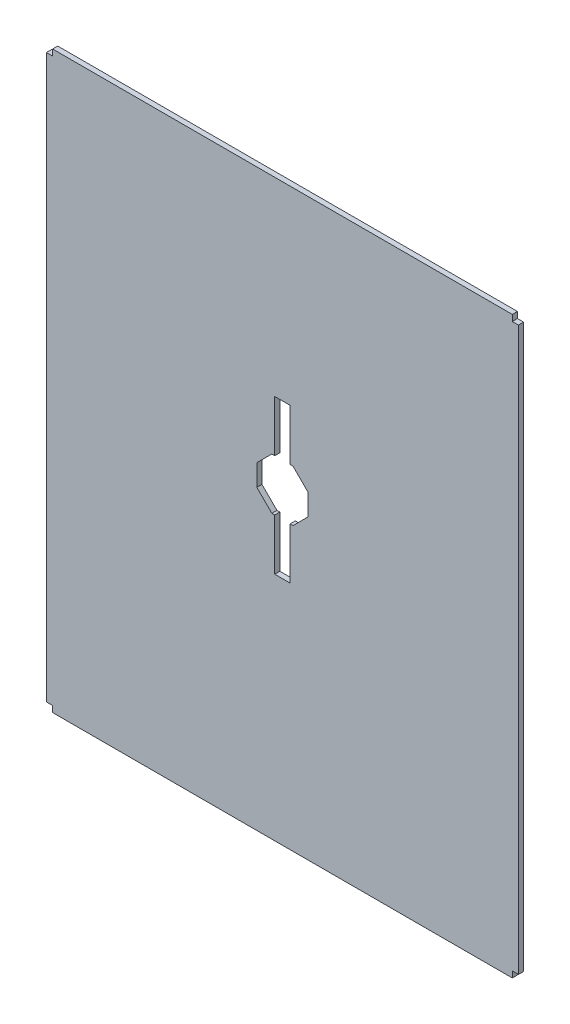
ISO-10303-21;
HEADER;
FILE_DESCRIPTION(('STEP AP214'),'2;1');
FILE_NAME('part.step','',(''),(''),'','','');
FILE_SCHEMA(('AUTOMOTIVE_DESIGN { 1 0 10303 214 1 1 1 1 }'));
ENDSEC;
DATA;
#1=APPLICATION_CONTEXT('core data for automotive mechanical design processes');
#2=APPLICATION_PROTOCOL_DEFINITION('international standard','automotive_design',2000,#1);
#3=PRODUCT_CONTEXT('',#1,'mechanical');
#4=PRODUCT('Part','Part','',(#3));
#5=PRODUCT_RELATED_PRODUCT_CATEGORY('part','',(#4));
#6=PRODUCT_DEFINITION_FORMATION('','',#4);
#7=PRODUCT_DEFINITION_CONTEXT('part definition',#1,'design');
#8=PRODUCT_DEFINITION('design','',#6,#7);
#9=PRODUCT_DEFINITION_SHAPE('','',#8);
#10=(LENGTH_UNIT() NAMED_UNIT(*) SI_UNIT(.MILLI.,.METRE.));
#11=(NAMED_UNIT(*) PLANE_ANGLE_UNIT() SI_UNIT($,.RADIAN.));
#12=(NAMED_UNIT(*) SI_UNIT($,.STERADIAN.) SOLID_ANGLE_UNIT());
#13=UNCERTAINTY_MEASURE_WITH_UNIT(LENGTH_MEASURE(1.E-05),#10,'distance_accuracy_value','');
#14=(GEOMETRIC_REPRESENTATION_CONTEXT(3) GLOBAL_UNCERTAINTY_ASSIGNED_CONTEXT((#13)) GLOBAL_UNIT_ASSIGNED_CONTEXT((#10,
#11,#12)) REPRESENTATION_CONTEXT('',''));
#15=CARTESIAN_POINT('',(0.,0.,0.));
#16=DIRECTION('',(0.,0.,1.));
#17=DIRECTION('',(1.,0.,0.));
#18=AXIS2_PLACEMENT_3D('',#15,#16,#17);
#19=CARTESIAN_POINT('',(230.,-280.,0.));
#20=DIRECTION('',(1.,0.,0.));
#21=DIRECTION('',(0.,1.,0.));
#22=AXIS2_PLACEMENT_3D('',#19,#20,#21);
#23=PLANE('',#22);
#24=DIRECTION('',(0.,0.,-1.));
#25=VECTOR('',#24,1.);
#26=CARTESIAN_POINT('',(230.,-274.,2.5));
#27=LINE('',#26,#25);
#28=CARTESIAN_POINT('',(230.,-274.,5.));
#29=VERTEX_POINT('',#28);
#30=CARTESIAN_POINT('',(230.,-274.,0.));
#31=VERTEX_POINT('',#30);
#32=EDGE_CURVE('E11',#29,#31,#27,.T.);
#33=ORIENTED_EDGE('',*,*,#32,.T.);
#34=DIRECTION('',(0.,1.,0.));
#35=VECTOR('',#34,1.);
#36=CARTESIAN_POINT('',(230.,-280.,0.));
#37=LINE('',#36,#35);
#38=CARTESIAN_POINT('',(230.,274.,0.));
#39=VERTEX_POINT('',#38);
#40=EDGE_CURVE('E24',#31,#39,#37,.T.);
#41=ORIENTED_EDGE('',*,*,#40,.T.);
#42=DIRECTION('',(0.,0.,1.));
#43=VECTOR('',#42,1.);
#44=CARTESIAN_POINT('',(230.,274.,0.));
#45=LINE('',#44,#43);
#46=CARTESIAN_POINT('',(230.,274.,5.));
#47=VERTEX_POINT('',#46);
#48=EDGE_CURVE('E502',#39,#47,#45,.T.);
#49=ORIENTED_EDGE('',*,*,#48,.T.);
#50=DIRECTION('',(0.,1.,0.));
#51=VECTOR('',#50,1.);
#52=CARTESIAN_POINT('',(230.,-280.,5.));
#53=LINE('',#52,#51);
#54=EDGE_CURVE('E499',#29,#47,#53,.T.);
#55=ORIENTED_EDGE('',*,*,#54,.F.);
#56=EDGE_LOOP('',(#33,#41,#49,#55));
#57=FACE_BOUND('',#56,.T.);
#58=ADVANCED_FACE('F16',(#57),#23,.T.);
#59=CARTESIAN_POINT('',(7.5,45.0088313866877,0.));
#60=DIRECTION('',(0.00117513237163571,-0.999999309531716,0.));
#61=DIRECTION('',(0.999999309531716,0.00117513237163571,0.));
#62=AXIS2_PLACEMENT_3D('',#59,#60,#61);
#63=PLANE('',#62);
#64=DIRECTION('',(0.999999309531716,0.00117513237163571,0.));
#65=VECTOR('',#64,1.);
#66=CARTESIAN_POINT('',(7.5,45.0088313866877,0.));
#67=LINE('',#66,#65);
#68=CARTESIAN_POINT('',(-10.3852430058506,44.987813844145,0.));
#69=VERTEX_POINT('',#68);
#70=CARTESIAN_POINT('',(-7.5,44.9912043889422,0.));
#71=VERTEX_POINT('',#70);
#72=EDGE_CURVE('E497',#69,#71,#67,.T.);
#73=ORIENTED_EDGE('',*,*,#72,.T.);
#74=DIRECTION('',(0.,0.,1.));
#75=VECTOR('',#74,1.);
#76=CARTESIAN_POINT('',(-7.5,44.9912043889423,0.));
#77=LINE('',#76,#75);
#78=CARTESIAN_POINT('',(-7.5,44.9912043889422,5.));
#79=VERTEX_POINT('',#78);
#80=EDGE_CURVE('E495',#71,#79,#77,.T.);
#81=ORIENTED_EDGE('',*,*,#80,.T.);
#82=DIRECTION('',(0.999999309531716,0.00117513237163571,0.));
#83=VECTOR('',#82,1.);
#84=CARTESIAN_POINT('',(-0.0528809412315551,44.9999557456662,5.));
#85=LINE('',#84,#83);
#86=CARTESIAN_POINT('',(-10.3852430058506,44.987813844145,5.));
#87=VERTEX_POINT('',#86);
#88=EDGE_CURVE('E492',#87,#79,#85,.T.);
#89=ORIENTED_EDGE('',*,*,#88,.F.);
#90=DIRECTION('',(0.,0.,1.));
#91=VECTOR('',#90,1.);
#92=CARTESIAN_POINT('',(-10.3852430058506,44.987813844145,0.));
#93=LINE('',#92,#91);
#94=EDGE_CURVE('E489',#69,#87,#93,.T.);
#95=ORIENTED_EDGE('',*,*,#94,.F.);
#96=EDGE_LOOP('',(#73,#81,#89,#95));
#97=FACE_BOUND('',#96,.T.);
#98=ADVANCED_FACE('F553',(#97),#63,.T.);
#99=CARTESIAN_POINT('',(-7.5,-55.,0.));
#100=DIRECTION('',(1.,0.,0.));
#101=DIRECTION('',(0.,1.,0.));
#102=AXIS2_PLACEMENT_3D('',#99,#100,#101);
#103=PLANE('',#102);
#104=DIRECTION('',(0.,1.,0.));
#105=VECTOR('',#104,1.);
#106=CARTESIAN_POINT('',(-7.5,-55.,0.));
#107=LINE('',#106,#105);
#108=CARTESIAN_POINT('',(-7.5,95.,0.));
#109=VERTEX_POINT('',#108);
#110=EDGE_CURVE('E487',#71,#109,#107,.T.);
#111=ORIENTED_EDGE('',*,*,#110,.T.);
#112=DIRECTION('',(0.,0.,1.));
#113=VECTOR('',#112,1.);
#114=CARTESIAN_POINT('',(-7.5,95.,0.));
#115=LINE('',#114,#113);
#116=CARTESIAN_POINT('',(-7.5,95.,5.));
#117=VERTEX_POINT('',#116);
#118=EDGE_CURVE('E485',#109,#117,#115,.T.);
#119=ORIENTED_EDGE('',*,*,#118,.T.);
#120=DIRECTION('',(0.,1.,0.));
#121=VECTOR('',#120,1.);
#122=CARTESIAN_POINT('',(-7.5,0.,5.));
#123=LINE('',#122,#121);
#124=EDGE_CURVE('E482',#79,#117,#123,.T.);
#125=ORIENTED_EDGE('',*,*,#124,.F.);
#126=ORIENTED_EDGE('',*,*,#80,.F.);
#127=EDGE_LOOP('',(#111,#119,#125,#126));
#128=FACE_BOUND('',#127,.T.);
#129=ADVANCED_FACE('F557',(#128),#103,.T.);
#130=CARTESIAN_POINT('',(-7.5,95.,0.));
#131=DIRECTION('',(0.,-1.,0.));
#132=DIRECTION('',(1.,0.,0.));
#133=AXIS2_PLACEMENT_3D('',#130,#131,#132);
#134=PLANE('',#133);
#135=DIRECTION('',(1.,0.,0.));
#136=VECTOR('',#135,1.);
#137=CARTESIAN_POINT('',(-7.5,95.,0.));
#138=LINE('',#137,#136);
#139=CARTESIAN_POINT('',(7.5,95.,0.));
#140=VERTEX_POINT('',#139);
#141=EDGE_CURVE('E480',#109,#140,#138,.T.);
#142=ORIENTED_EDGE('',*,*,#141,.T.);
#143=DIRECTION('',(0.,0.,1.));
#144=VECTOR('',#143,1.);
#145=CARTESIAN_POINT('',(7.5,95.,0.));
#146=LINE('',#145,#144);
#147=CARTESIAN_POINT('',(7.5,95.,5.));
#148=VERTEX_POINT('',#147);
#149=EDGE_CURVE('E478',#140,#148,#146,.T.);
#150=ORIENTED_EDGE('',*,*,#149,.T.);
#151=DIRECTION('',(1.,0.,0.));
#152=VECTOR('',#151,1.);
#153=CARTESIAN_POINT('',(-7.5,95.,5.));
#154=LINE('',#153,#152);
#155=EDGE_CURVE('E475',#117,#148,#154,.T.);
#156=ORIENTED_EDGE('',*,*,#155,.F.);
#157=ORIENTED_EDGE('',*,*,#118,.F.);
#158=EDGE_LOOP('',(#142,#150,#156,#157));
#159=FACE_BOUND('',#158,.T.);
#160=ADVANCED_FACE('F563',(#159),#134,.T.);
#161=CARTESIAN_POINT('',(7.5,-4.99120313675039,0.));
#162=DIRECTION('',(-1.,0.,0.));
#163=DIRECTION('',(0.,-1.,0.));
#164=AXIS2_PLACEMENT_3D('',#161,#162,#163);
#165=PLANE('',#164);
#166=DIRECTION('',(0.,-1.,0.));
#167=VECTOR('',#166,1.);
#168=CARTESIAN_POINT('',(7.5,-4.99120313675039,0.));
#169=LINE('',#168,#167);
#170=CARTESIAN_POINT('',(7.5,45.0088313866877,0.));
#171=VERTEX_POINT('',#170);
#172=EDGE_CURVE('E473',#140,#171,#169,.T.);
#173=ORIENTED_EDGE('',*,*,#172,.T.);
#174=DIRECTION('',(0.,0.,1.));
#175=VECTOR('',#174,1.);
#176=CARTESIAN_POINT('',(7.5,45.0088313866877,0.));
#177=LINE('',#176,#175);
#178=CARTESIAN_POINT('',(7.5,45.0088313866877,5.));
#179=VERTEX_POINT('',#178);
#180=EDGE_CURVE('E471',#171,#179,#177,.T.);
#181=ORIENTED_EDGE('',*,*,#180,.T.);
#182=DIRECTION('',(0.,-1.,0.));
#183=VECTOR('',#182,1.);
#184=CARTESIAN_POINT('',(7.5,0.,5.));
#185=LINE('',#184,#183);
#186=EDGE_CURVE('E466',#148,#179,#185,.T.);
#187=ORIENTED_EDGE('',*,*,#186,.F.);
#188=ORIENTED_EDGE('',*,*,#149,.F.);
#189=EDGE_LOOP('',(#173,#181,#187,#188));
#190=FACE_BOUND('',#189,.T.);
#191=ADVANCED_FACE('F569',(#190),#165,.T.);
#192=DIRECTION('',(0.999999309531716,0.00117513237163571,0.));
#193=VECTOR('',#192,1.);
#194=CARTESIAN_POINT('',(10.3254208127377,45.0121516324407,0.));
#195=LINE('',#194,#193);
#196=CARTESIAN_POINT('',(10.3254208127377,45.0121516324407,0.));
#197=VERTEX_POINT('',#196);
#198=EDGE_CURVE('E462',#171,#197,#195,.T.);
#199=ORIENTED_EDGE('',*,*,#198,.T.);
#200=DIRECTION('',(0.,0.,1.));
#201=VECTOR('',#200,1.);
#202=CARTESIAN_POINT('',(10.3254208127377,45.0121516324407,0.));
#203=LINE('',#202,#201);
#204=CARTESIAN_POINT('',(10.3254208127377,45.0121516324407,5.));
#205=VERTEX_POINT('',#204);
#206=EDGE_CURVE('E458',#197,#205,#203,.T.);
#207=ORIENTED_EDGE('',*,*,#206,.T.);
#208=DIRECTION('',(0.999999309531716,0.00117513237163571,0.));
#209=VECTOR('',#208,1.);
#210=CARTESIAN_POINT('',(10.3254208127377,45.0121516324407,5.));
#211=LINE('',#210,#209);
#212=EDGE_CURVE('E453',#179,#205,#211,.T.);
#213=ORIENTED_EDGE('',*,*,#212,.F.);
#214=ORIENTED_EDGE('',*,*,#180,.F.);
#215=EDGE_LOOP('',(#199,#207,#213,#214));
#216=FACE_BOUND('',#215,.T.);
#217=ADVANCED_FACE('F559',(#216),#63,.T.);
#218=CARTESIAN_POINT('',(10.3254208127377,45.0121516324407,0.));
#219=DIRECTION('',(-0.706275348882967,-0.707937237020517,0.));
#220=DIRECTION('',(0.707937237020517,-0.706275348882967,0.));
#221=AXIS2_PLACEMENT_3D('',#218,#219,#220);
#222=PLANE('',#221);
#223=DIRECTION('',(0.707937237020517,-0.706275348882967,0.));
#224=VECTOR('',#223,1.);
#225=CARTESIAN_POINT('',(24.9872810568795,30.384710218585,0.));
#226=LINE('',#225,#224);
#227=CARTESIAN_POINT('',(24.9872810568795,30.384710218585,0.));
#228=VERTEX_POINT('',#227);
#229=EDGE_CURVE('E449',#197,#228,#226,.T.);
#230=ORIENTED_EDGE('',*,*,#229,.T.);
#231=DIRECTION('',(0.,0.,1.));
#232=VECTOR('',#231,1.);
#233=CARTESIAN_POINT('',(24.9872810568795,30.384710218585,0.));
#234=LINE('',#233,#232);
#235=CARTESIAN_POINT('',(24.9872810568795,30.384710218585,5.));
#236=VERTEX_POINT('',#235);
#237=EDGE_CURVE('E445',#228,#236,#234,.T.);
#238=ORIENTED_EDGE('',*,*,#237,.T.);
#239=DIRECTION('',(0.707937237020517,-0.706275348882967,0.));
#240=VECTOR('',#239,1.);
#241=CARTESIAN_POINT('',(24.9872810568795,30.384710218585,5.));
#242=LINE('',#241,#240);
#243=EDGE_CURVE('E440',#205,#236,#242,.T.);
#244=ORIENTED_EDGE('',*,*,#243,.F.);
#245=ORIENTED_EDGE('',*,*,#206,.F.);
#246=EDGE_LOOP('',(#230,#238,#244,#245));
#247=FACE_BOUND('',#246,.T.);
#248=ADVANCED_FACE('F568',(#247),#222,.T.);
#249=CARTESIAN_POINT('',(24.9872810568795,30.384710218585,0.));
#250=DIRECTION('',(-0.999999309531716,-0.00117513237163549,0.));
#251=DIRECTION('',(0.00117513237163549,-0.999999309531716,0.));
#252=AXIS2_PLACEMENT_3D('',#249,#250,#251);
#253=PLANE('',#252);
#254=DIRECTION('',(0.00117513237163549,-0.999999309531716,0.));
#255=VECTOR('',#254,1.);
#256=CARTESIAN_POINT('',(25.0116188451752,9.67404639999663,0.));
#257=LINE('',#256,#255);
#258=CARTESIAN_POINT('',(25.0116188451752,9.67404639999663,0.));
#259=VERTEX_POINT('',#258);
#260=EDGE_CURVE('E436',#228,#259,#257,.T.);
#261=ORIENTED_EDGE('',*,*,#260,.T.);
#262=DIRECTION('',(0.,0.,1.));
#263=VECTOR('',#262,1.);
#264=CARTESIAN_POINT('',(25.0116188451752,9.67404639999663,0.));
#265=LINE('',#264,#263);
#266=CARTESIAN_POINT('',(25.0116188451752,9.67404639999663,5.));
#267=VERTEX_POINT('',#266);
#268=EDGE_CURVE('E432',#259,#267,#265,.T.);
#269=ORIENTED_EDGE('',*,*,#268,.T.);
#270=DIRECTION('',(0.00117513237163549,-0.999999309531716,0.));
#271=VECTOR('',#270,1.);
#272=CARTESIAN_POINT('',(25.0116188451752,9.67404639999663,5.));
#273=LINE('',#272,#271);
#274=EDGE_CURVE('E427',#236,#267,#273,.T.);
#275=ORIENTED_EDGE('',*,*,#274,.F.);
#276=ORIENTED_EDGE('',*,*,#237,.F.);
#277=EDGE_LOOP('',(#261,#269,#275,#276));
#278=FACE_BOUND('',#277,.T.);
#279=ADVANCED_FACE('F575',(#278),#253,.T.);
#280=CARTESIAN_POINT('',(25.0116188451752,9.67404639999663,0.));
#281=DIRECTION('',(-0.707937237020517,0.706275348882967,0.));
#282=DIRECTION('',(-0.706275348882967,-0.707937237020517,0.));
#283=AXIS2_PLACEMENT_3D('',#280,#281,#282);
#284=PLANE('',#283);
#285=DIRECTION('',(-0.706275348882967,-0.707937237020517,0.));
#286=VECTOR('',#285,1.);
#287=CARTESIAN_POINT('',(10.3841774313195,-4.9878138441451,0.));
#288=LINE('',#287,#286);
#289=CARTESIAN_POINT('',(10.3841774313195,-4.9878138441451,0.));
#290=VERTEX_POINT('',#289);
#291=EDGE_CURVE('E425',#259,#290,#288,.T.);
#292=ORIENTED_EDGE('',*,*,#291,.T.);
#293=DIRECTION('',(0.,0.,1.));
#294=VECTOR('',#293,1.);
#295=CARTESIAN_POINT('',(10.3841774313195,-4.9878138441451,0.));
#296=LINE('',#295,#294);
#297=CARTESIAN_POINT('',(10.3841774313195,-4.9878138441451,5.));
#298=VERTEX_POINT('',#297);
#299=EDGE_CURVE('E421',#290,#298,#296,.T.);
#300=ORIENTED_EDGE('',*,*,#299,.T.);
#301=DIRECTION('',(-0.706275348882967,-0.707937237020517,0.));
#302=VECTOR('',#301,1.);
#303=CARTESIAN_POINT('',(10.3841774313195,-4.9878138441451,5.));
#304=LINE('',#303,#302);
#305=EDGE_CURVE('E418',#267,#298,#304,.T.);
#306=ORIENTED_EDGE('',*,*,#305,.F.);
#307=ORIENTED_EDGE('',*,*,#268,.F.);
#308=EDGE_LOOP('',(#292,#300,#306,#307));
#309=FACE_BOUND('',#308,.T.);
#310=ADVANCED_FACE('F599',(#309),#284,.T.);
#311=CARTESIAN_POINT('',(-7.5,-5.0088301344958,0.));
#312=DIRECTION('',(-0.00117513237163539,0.999999309531716,0.));
#313=DIRECTION('',(-0.999999309531716,-0.00117513237163539,0.));
#314=AXIS2_PLACEMENT_3D('',#311,#312,#313);
#315=PLANE('',#314);
#316=DIRECTION('',(-0.999999309531716,-0.00117513237163539,0.));
#317=VECTOR('',#316,1.);
#318=CARTESIAN_POINT('',(-7.5,-5.0088301344958,0.));
#319=LINE('',#318,#317);
#320=CARTESIAN_POINT('',(7.5,-4.99120313675038,0.));
#321=VERTEX_POINT('',#320);
#322=EDGE_CURVE('E416',#290,#321,#319,.T.);
#323=ORIENTED_EDGE('',*,*,#322,.T.);
#324=DIRECTION('',(0.,0.,1.));
#325=VECTOR('',#324,1.);
#326=CARTESIAN_POINT('',(7.5,-4.99120313675039,0.));
#327=LINE('',#326,#325);
#328=CARTESIAN_POINT('',(7.5,-4.99120313675038,5.));
#329=VERTEX_POINT('',#328);
#330=EDGE_CURVE('E414',#321,#329,#327,.T.);
#331=ORIENTED_EDGE('',*,*,#330,.T.);
#332=DIRECTION('',(-0.999999309531716,-0.00117513237163539,0.));
#333=VECTOR('',#332,1.);
#334=CARTESIAN_POINT('',(0.00587567735022894,-5.00000973091967,5.));
#335=LINE('',#334,#333);
#336=EDGE_CURVE('E409',#298,#329,#335,.T.);
#337=ORIENTED_EDGE('',*,*,#336,.F.);
#338=ORIENTED_EDGE('',*,*,#299,.F.);
#339=EDGE_LOOP('',(#323,#331,#337,#338));
#340=FACE_BOUND('',#339,.T.);
#341=ADVANCED_FACE('F646',(#340),#315,.T.);
#342=DIRECTION('',(0.,-1.,0.));
#343=VECTOR('',#342,1.);
#344=CARTESIAN_POINT('',(7.5,95.,0.));
#345=LINE('',#344,#343);
#346=CARTESIAN_POINT('',(7.5,-55.,0.));
#347=VERTEX_POINT('',#346);
#348=EDGE_CURVE('E405',#321,#347,#345,.T.);
#349=ORIENTED_EDGE('',*,*,#348,.T.);
#350=DIRECTION('',(0.,0.,1.));
#351=VECTOR('',#350,1.);
#352=CARTESIAN_POINT('',(7.5,-55.,0.));
#353=LINE('',#352,#351);
#354=CARTESIAN_POINT('',(7.5,-55.,5.));
#355=VERTEX_POINT('',#354);
#356=EDGE_CURVE('E401',#347,#355,#353,.T.);
#357=ORIENTED_EDGE('',*,*,#356,.T.);
#358=DIRECTION('',(0.,-1.,0.));
#359=VECTOR('',#358,1.);
#360=CARTESIAN_POINT('',(7.5,95.,5.));
#361=LINE('',#360,#359);
#362=EDGE_CURVE('E396',#329,#355,#361,.T.);
#363=ORIENTED_EDGE('',*,*,#362,.F.);
#364=ORIENTED_EDGE('',*,*,#330,.F.);
#365=EDGE_LOOP('',(#349,#357,#363,#364));
#366=FACE_BOUND('',#365,.T.);
#367=ADVANCED_FACE('F580',(#366),#165,.T.);
#368=CARTESIAN_POINT('',(7.5,-55.,0.));
#369=DIRECTION('',(0.,1.,0.));
#370=DIRECTION('',(-1.,0.,0.));
#371=AXIS2_PLACEMENT_3D('',#368,#369,#370);
#372=PLANE('',#371);
#373=DIRECTION('',(-1.,0.,0.));
#374=VECTOR('',#373,1.);
#375=CARTESIAN_POINT('',(7.5,-55.,0.));
#376=LINE('',#375,#374);
#377=CARTESIAN_POINT('',(-7.5,-55.,0.));
#378=VERTEX_POINT('',#377);
#379=EDGE_CURVE('E392',#347,#378,#376,.T.);
#380=ORIENTED_EDGE('',*,*,#379,.T.);
#381=DIRECTION('',(0.,0.,1.));
#382=VECTOR('',#381,1.);
#383=CARTESIAN_POINT('',(-7.5,-55.,0.));
#384=LINE('',#383,#382);
#385=CARTESIAN_POINT('',(-7.5,-55.,5.));
#386=VERTEX_POINT('',#385);
#387=EDGE_CURVE('E388',#378,#386,#384,.T.);
#388=ORIENTED_EDGE('',*,*,#387,.T.);
#389=DIRECTION('',(-1.,0.,0.));
#390=VECTOR('',#389,1.);
#391=CARTESIAN_POINT('',(7.5,-55.,5.));
#392=LINE('',#391,#390);
#393=EDGE_CURVE('E383',#355,#386,#392,.T.);
#394=ORIENTED_EDGE('',*,*,#393,.F.);
#395=ORIENTED_EDGE('',*,*,#356,.F.);
#396=EDGE_LOOP('',(#380,#388,#394,#395));
#397=FACE_BOUND('',#396,.T.);
#398=ADVANCED_FACE('F639',(#397),#372,.T.);
#399=DIRECTION('',(0.,1.,0.));
#400=VECTOR('',#399,1.);
#401=CARTESIAN_POINT('',(-7.5,-55.,0.));
#402=LINE('',#401,#400);
#403=CARTESIAN_POINT('',(-7.5,-5.0088301344958,0.));
#404=VERTEX_POINT('',#403);
#405=EDGE_CURVE('E379',#378,#404,#402,.T.);
#406=ORIENTED_EDGE('',*,*,#405,.T.);
#407=DIRECTION('',(0.,0.,1.));
#408=VECTOR('',#407,1.);
#409=CARTESIAN_POINT('',(-7.5,-5.0088301344958,0.));
#410=LINE('',#409,#408);
#411=CARTESIAN_POINT('',(-7.5,-5.00883013449579,5.));
#412=VERTEX_POINT('',#411);
#413=EDGE_CURVE('E375',#404,#412,#410,.T.);
#414=ORIENTED_EDGE('',*,*,#413,.T.);
#415=DIRECTION('',(0.,1.,0.));
#416=VECTOR('',#415,1.);
#417=CARTESIAN_POINT('',(-7.5,-55.,5.));
#418=LINE('',#417,#416);
#419=EDGE_CURVE('E370',#386,#412,#418,.T.);
#420=ORIENTED_EDGE('',*,*,#419,.F.);
#421=ORIENTED_EDGE('',*,*,#387,.F.);
#422=EDGE_LOOP('',(#406,#414,#420,#421));
#423=FACE_BOUND('',#422,.T.);
#424=ADVANCED_FACE('F566',(#423),#103,.T.);
#425=DIRECTION('',(-0.999999309531716,-0.00117513237163539,0.));
#426=VECTOR('',#425,1.);
#427=CARTESIAN_POINT('',(-10.3264863872689,-5.01215163244085,0.));
#428=LINE('',#427,#426);
#429=CARTESIAN_POINT('',(-10.3264863872689,-5.01215163244085,0.));
#430=VERTEX_POINT('',#429);
#431=EDGE_CURVE('E366',#404,#430,#428,.T.);
#432=ORIENTED_EDGE('',*,*,#431,.T.);
#433=DIRECTION('',(0.,0.,1.));
#434=VECTOR('',#433,1.);
#435=CARTESIAN_POINT('',(-10.3264863872689,-5.01215163244085,0.));
#436=LINE('',#435,#434);
#437=CARTESIAN_POINT('',(-10.3264863872689,-5.01215163244085,5.));
#438=VERTEX_POINT('',#437);
#439=EDGE_CURVE('E362',#430,#438,#436,.T.);
#440=ORIENTED_EDGE('',*,*,#439,.T.);
#441=DIRECTION('',(-0.999999309531716,-0.00117513237163539,0.));
#442=VECTOR('',#441,1.);
#443=CARTESIAN_POINT('',(-10.3264863872689,-5.01215163244085,5.));
#444=LINE('',#443,#442);
#445=EDGE_CURVE('E357',#412,#438,#444,.T.);
#446=ORIENTED_EDGE('',*,*,#445,.F.);
#447=ORIENTED_EDGE('',*,*,#413,.F.);
#448=EDGE_LOOP('',(#432,#440,#446,#447));
#449=FACE_BOUND('',#448,.T.);
#450=ADVANCED_FACE('F632',(#449),#315,.T.);
#451=CARTESIAN_POINT('',(-10.3264863872689,-5.01215163244085,0.));
#452=DIRECTION('',(0.706275348882966,0.707937237020518,0.));
#453=DIRECTION('',(-0.707937237020518,0.706275348882966,0.));
#454=AXIS2_PLACEMENT_3D('',#451,#452,#453);
#455=PLANE('',#454);
#456=DIRECTION('',(-0.707937237020518,0.706275348882966,0.));
#457=VECTOR('',#456,1.);
#458=CARTESIAN_POINT('',(-24.9883466314106,9.61528978141485,0.));
#459=LINE('',#458,#457);
#460=CARTESIAN_POINT('',(-24.9883466314106,9.61528978141485,0.));
#461=VERTEX_POINT('',#460);
#462=EDGE_CURVE('E353',#430,#461,#459,.T.);
#463=ORIENTED_EDGE('',*,*,#462,.T.);
#464=DIRECTION('',(0.,0.,1.));
#465=VECTOR('',#464,1.);
#466=CARTESIAN_POINT('',(-24.9883466314106,9.61528978141485,0.));
#467=LINE('',#466,#465);
#468=CARTESIAN_POINT('',(-24.9883466314106,9.61528978141485,5.));
#469=VERTEX_POINT('',#468);
#470=EDGE_CURVE('E349',#461,#469,#467,.T.);
#471=ORIENTED_EDGE('',*,*,#470,.T.);
#472=DIRECTION('',(-0.707937237020518,0.706275348882966,0.));
#473=VECTOR('',#472,1.);
#474=CARTESIAN_POINT('',(-24.9883466314106,9.61528978141485,5.));
#475=LINE('',#474,#473);
#476=EDGE_CURVE('E344',#438,#469,#475,.T.);
#477=ORIENTED_EDGE('',*,*,#476,.F.);
#478=ORIENTED_EDGE('',*,*,#439,.F.);
#479=EDGE_LOOP('',(#463,#471,#477,#478));
#480=FACE_BOUND('',#479,.T.);
#481=ADVANCED_FACE('F625',(#480),#455,.T.);
#482=CARTESIAN_POINT('',(-24.9883466314106,9.61528978141485,0.));
#483=DIRECTION('',(0.999999309531716,0.00117513237163549,0.));
#484=DIRECTION('',(-0.00117513237163549,0.999999309531716,0.));
#485=AXIS2_PLACEMENT_3D('',#482,#483,#484);
#486=PLANE('',#485);
#487=DIRECTION('',(-0.00117513237163549,0.999999309531716,0.));
#488=VECTOR('',#487,1.);
#489=CARTESIAN_POINT('',(-25.0126844197064,30.3259536000032,0.));
#490=LINE('',#489,#488);
#491=CARTESIAN_POINT('',(-25.0126844197064,30.3259536000032,0.));
#492=VERTEX_POINT('',#491);
#493=EDGE_CURVE('E340',#461,#492,#490,.T.);
#494=ORIENTED_EDGE('',*,*,#493,.T.);
#495=DIRECTION('',(0.,0.,1.));
#496=VECTOR('',#495,1.);
#497=CARTESIAN_POINT('',(-25.0126844197064,30.3259536000032,0.));
#498=LINE('',#497,#496);
#499=CARTESIAN_POINT('',(-25.0126844197064,30.3259536000032,5.));
#500=VERTEX_POINT('',#499);
#501=EDGE_CURVE('E336',#492,#500,#498,.T.);
#502=ORIENTED_EDGE('',*,*,#501,.T.);
#503=DIRECTION('',(-0.00117513237163549,0.999999309531716,0.));
#504=VECTOR('',#503,1.);
#505=CARTESIAN_POINT('',(-25.0126844197064,30.3259536000032,5.));
#506=LINE('',#505,#504);
#507=EDGE_CURVE('E331',#469,#500,#506,.T.);
#508=ORIENTED_EDGE('',*,*,#507,.F.);
#509=ORIENTED_EDGE('',*,*,#470,.F.);
#510=EDGE_LOOP('',(#494,#502,#508,#509));
#511=FACE_BOUND('',#510,.T.);
#512=ADVANCED_FACE('F621',(#511),#486,.T.);
#513=CARTESIAN_POINT('',(-25.0126844197064,30.3259536000032,0.));
#514=DIRECTION('',(0.707937237020517,-0.706275348882967,0.));
#515=DIRECTION('',(0.706275348882967,0.707937237020517,0.));
#516=AXIS2_PLACEMENT_3D('',#513,#514,#515);
#517=PLANE('',#516);
#518=DIRECTION('',(0.706275348882967,0.707937237020517,0.));
#519=VECTOR('',#518,1.);
#520=CARTESIAN_POINT('',(-10.3852430058506,44.987813844145,0.));
#521=LINE('',#520,#519);
#522=EDGE_CURVE('E326',#492,#69,#521,.T.);
#523=ORIENTED_EDGE('',*,*,#522,.T.);
#524=ORIENTED_EDGE('',*,*,#94,.T.);
#525=DIRECTION('',(0.706275348882967,0.707937237020517,0.));
#526=VECTOR('',#525,1.);
#527=CARTESIAN_POINT('',(-10.3852430058506,44.987813844145,5.));
#528=LINE('',#527,#526);
#529=EDGE_CURVE('E321',#500,#87,#528,.T.);
#530=ORIENTED_EDGE('',*,*,#529,.F.);
#531=ORIENTED_EDGE('',*,*,#501,.F.);
#532=EDGE_LOOP('',(#523,#524,#530,#531));
#533=FACE_BOUND('',#532,.T.);
#534=ADVANCED_FACE('F617',(#533),#517,.T.);
#535=CARTESIAN_POINT('',(0.,0.,0.));
#536=DIRECTION('',(0.,0.,1.));
#537=DIRECTION('',(1.,0.,0.));
#538=AXIS2_PLACEMENT_3D('',#535,#536,#537);
#539=PLANE('',#538);
#540=ORIENTED_EDGE('',*,*,#72,.F.);
#541=ORIENTED_EDGE('',*,*,#522,.F.);
#542=ORIENTED_EDGE('',*,*,#493,.F.);
#543=ORIENTED_EDGE('',*,*,#462,.F.);
#544=ORIENTED_EDGE('',*,*,#431,.F.);
#545=ORIENTED_EDGE('',*,*,#405,.F.);
#546=ORIENTED_EDGE('',*,*,#379,.F.);
#547=ORIENTED_EDGE('',*,*,#348,.F.);
#548=ORIENTED_EDGE('',*,*,#322,.F.);
#549=ORIENTED_EDGE('',*,*,#291,.F.);
#550=ORIENTED_EDGE('',*,*,#260,.F.);
#551=ORIENTED_EDGE('',*,*,#229,.F.);
#552=ORIENTED_EDGE('',*,*,#198,.F.);
#553=ORIENTED_EDGE('',*,*,#172,.F.);
#554=ORIENTED_EDGE('',*,*,#141,.F.);
#555=ORIENTED_EDGE('',*,*,#110,.F.);
#556=EDGE_LOOP('',(#540,#541,#542,#543,#544,#545,#546,#547,#548,#549,#550,#551,#552,#553,#554,#555));
#557=FACE_BOUND('',#556,.T.);
#558=DIRECTION('',(0.,-1.,0.));
#559=VECTOR('',#558,1.);
#560=CARTESIAN_POINT('',(224.,-140.,0.));
#561=LINE('',#560,#559);
#562=CARTESIAN_POINT('',(224.,-274.,0.));
#563=VERTEX_POINT('',#562);
#564=CARTESIAN_POINT('',(224.,-280.,0.));
#565=VERTEX_POINT('',#564);
#566=EDGE_CURVE('E317',#563,#565,#561,.T.);
#567=ORIENTED_EDGE('',*,*,#566,.T.);
#568=DIRECTION('',(1.,0.,0.));
#569=VECTOR('',#568,1.);
#570=CARTESIAN_POINT('',(-230.,-280.,0.));
#571=LINE('',#570,#569);
#572=CARTESIAN_POINT('',(-224.,-280.,0.));
#573=VERTEX_POINT('',#572);
#574=EDGE_CURVE('E214',#573,#565,#571,.T.);
#575=ORIENTED_EDGE('',*,*,#574,.F.);
#576=DIRECTION('',(0.,-1.,0.));
#577=VECTOR('',#576,1.);
#578=CARTESIAN_POINT('',(-224.,-137.25,0.));
#579=LINE('',#578,#577);
#580=CARTESIAN_POINT('',(-224.,-274.,0.));
#581=VERTEX_POINT('',#580);
#582=EDGE_CURVE('E311',#581,#573,#579,.T.);
#583=ORIENTED_EDGE('',*,*,#582,.F.);
#584=DIRECTION('',(1.,0.,0.));
#585=VECTOR('',#584,1.);
#586=CARTESIAN_POINT('',(224.5,-274.,0.));
#587=LINE('',#586,#585);
#588=CARTESIAN_POINT('',(-230.,-274.,0.));
#589=VERTEX_POINT('',#588);
#590=EDGE_CURVE('E306',#589,#581,#587,.T.);
#591=ORIENTED_EDGE('',*,*,#590,.F.);
#592=DIRECTION('',(0.,-1.,0.));
#593=VECTOR('',#592,1.);
#594=CARTESIAN_POINT('',(-230.,280.,0.));
#595=LINE('',#594,#593);
#596=CARTESIAN_POINT('',(-230.,274.,0.));
#597=VERTEX_POINT('',#596);
#598=EDGE_CURVE('E301',#597,#589,#595,.T.);
#599=ORIENTED_EDGE('',*,*,#598,.F.);
#600=DIRECTION('',(1.,0.,0.));
#601=VECTOR('',#600,1.);
#602=CARTESIAN_POINT('',(-112.25,274.,0.));
#603=LINE('',#602,#601);
#604=CARTESIAN_POINT('',(-224.,274.,0.));
#605=VERTEX_POINT('',#604);
#606=EDGE_CURVE('E299',#597,#605,#603,.T.);
#607=ORIENTED_EDGE('',*,*,#606,.T.);
#608=DIRECTION('',(0.,1.,0.));
#609=VECTOR('',#608,1.);
#610=CARTESIAN_POINT('',(-224.,0.,0.));
#611=LINE('',#610,#609);
#612=CARTESIAN_POINT('',(-224.,280.,0.));
#613=VERTEX_POINT('',#612);
#614=EDGE_CURVE('E297',#605,#613,#611,.T.);
#615=ORIENTED_EDGE('',*,*,#614,.T.);
#616=DIRECTION('',(-1.,0.,0.));
#617=VECTOR('',#616,1.);
#618=CARTESIAN_POINT('',(230.,280.,0.));
#619=LINE('',#618,#617);
#620=CARTESIAN_POINT('',(224.,280.,0.));
#621=VERTEX_POINT('',#620);
#622=EDGE_CURVE('E294',#621,#613,#619,.T.);
#623=ORIENTED_EDGE('',*,*,#622,.F.);
#624=DIRECTION('',(0.,-1.,0.));
#625=VECTOR('',#624,1.);
#626=CARTESIAN_POINT('',(224.,0.,0.));
#627=LINE('',#626,#625);
#628=CARTESIAN_POINT('',(224.,274.,0.));
#629=VERTEX_POINT('',#628);
#630=EDGE_CURVE('E292',#621,#629,#627,.T.);
#631=ORIENTED_EDGE('',*,*,#630,.T.);
#632=DIRECTION('',(1.,0.,0.));
#633=VECTOR('',#632,1.);
#634=CARTESIAN_POINT('',(0.,274.,0.));
#635=LINE('',#634,#633);
#636=EDGE_CURVE('E288',#629,#39,#635,.T.);
#637=ORIENTED_EDGE('',*,*,#636,.T.);
#638=ORIENTED_EDGE('',*,*,#40,.F.);
#639=DIRECTION('',(-1.,0.,0.));
#640=VECTOR('',#639,1.);
#641=CARTESIAN_POINT('',(112.25,-274.,0.));
#642=LINE('',#641,#640);
#643=EDGE_CURVE('E286',#31,#563,#642,.T.);
#644=ORIENTED_EDGE('',*,*,#643,.T.);
#645=EDGE_LOOP('',(#567,#575,#583,#591,#599,#607,#615,#623,#631,#637,#638,#644));
#646=FACE_BOUND('',#645,.T.);
#647=ADVANCED_FACE('F519',(#557,#646),#539,.F.);
#648=CARTESIAN_POINT('',(-224.5,274.,5.));
#649=DIRECTION('',(0.,-1.,0.));
#650=DIRECTION('',(0.,0.,-1.));
#651=AXIS2_PLACEMENT_3D('',#648,#649,#650);
#652=PLANE('',#651);
#653=ORIENTED_EDGE('',*,*,#636,.F.);
#654=DIRECTION('',(0.,0.,1.));
#655=VECTOR('',#654,1.);
#656=CARTESIAN_POINT('',(224.,274.,5.));
#657=LINE('',#656,#655);
#658=CARTESIAN_POINT('',(224.,274.,5.));
#659=VERTEX_POINT('',#658);
#660=EDGE_CURVE('E284',#629,#659,#657,.T.);
#661=ORIENTED_EDGE('',*,*,#660,.T.);
#662=DIRECTION('',(-1.,0.,0.));
#663=VECTOR('',#662,1.);
#664=CARTESIAN_POINT('',(0.,274.,5.));
#665=LINE('',#664,#663);
#666=EDGE_CURVE('E281',#47,#659,#665,.T.);
#667=ORIENTED_EDGE('',*,*,#666,.F.);
#668=ORIENTED_EDGE('',*,*,#48,.F.);
#669=EDGE_LOOP('',(#653,#661,#667,#668));
#670=FACE_BOUND('',#669,.T.);
#671=ADVANCED_FACE('F512',(#670),#652,.F.);
#672=CARTESIAN_POINT('',(224.,-280.,5.));
#673=DIRECTION('',(-1.,0.,0.));
#674=DIRECTION('',(0.,0.,1.));
#675=AXIS2_PLACEMENT_3D('',#672,#673,#674);
#676=PLANE('',#675);
#677=ORIENTED_EDGE('',*,*,#630,.F.);
#678=DIRECTION('',(0.,0.,-1.));
#679=VECTOR('',#678,1.);
#680=CARTESIAN_POINT('',(224.,280.,0.));
#681=LINE('',#680,#679);
#682=CARTESIAN_POINT('',(224.,280.,5.));
#683=VERTEX_POINT('',#682);
#684=EDGE_CURVE('E278',#683,#621,#681,.T.);
#685=ORIENTED_EDGE('',*,*,#684,.F.);
#686=DIRECTION('',(0.,1.,0.));
#687=VECTOR('',#686,1.);
#688=CARTESIAN_POINT('',(224.,0.,5.));
#689=LINE('',#688,#687);
#690=EDGE_CURVE('E273',#659,#683,#689,.T.);
#691=ORIENTED_EDGE('',*,*,#690,.F.);
#692=ORIENTED_EDGE('',*,*,#660,.F.);
#693=EDGE_LOOP('',(#677,#685,#691,#692));
#694=FACE_BOUND('',#693,.T.);
#695=ADVANCED_FACE('F522',(#694),#676,.F.);
#696=ORIENTED_EDGE('',*,*,#606,.F.);
#697=DIRECTION('',(0.,0.,-1.));
#698=VECTOR('',#697,1.);
#699=CARTESIAN_POINT('',(-230.,274.,2.5));
#700=LINE('',#699,#698);
#701=CARTESIAN_POINT('',(-230.,274.,5.));
#702=VERTEX_POINT('',#701);
#703=EDGE_CURVE('E268',#702,#597,#700,.T.);
#704=ORIENTED_EDGE('',*,*,#703,.F.);
#705=DIRECTION('',(-1.,0.,0.));
#706=VECTOR('',#705,1.);
#707=CARTESIAN_POINT('',(-112.25,274.,5.));
#708=LINE('',#707,#706);
#709=CARTESIAN_POINT('',(-224.,274.,5.));
#710=VERTEX_POINT('',#709);
#711=EDGE_CURVE('E265',#710,#702,#708,.T.);
#712=ORIENTED_EDGE('',*,*,#711,.F.);
#713=DIRECTION('',(0.,0.,-1.));
#714=VECTOR('',#713,1.);
#715=CARTESIAN_POINT('',(-224.,274.,5.));
#716=LINE('',#715,#714);
#717=EDGE_CURVE('E262',#710,#605,#716,.T.);
#718=ORIENTED_EDGE('',*,*,#717,.T.);
#719=EDGE_LOOP('',(#696,#704,#712,#718));
#720=FACE_BOUND('',#719,.T.);
#721=ADVANCED_FACE('F534',(#720),#652,.F.);
#722=CARTESIAN_POINT('',(230.,280.,0.));
#723=DIRECTION('',(0.,1.,0.));
#724=DIRECTION('',(-1.,0.,0.));
#725=AXIS2_PLACEMENT_3D('',#722,#723,#724);
#726=PLANE('',#725);
#727=DIRECTION('',(0.,0.,1.));
#728=VECTOR('',#727,1.);
#729=CARTESIAN_POINT('',(-224.,280.,0.));
#730=LINE('',#729,#728);
#731=CARTESIAN_POINT('',(-224.,280.,5.));
#732=VERTEX_POINT('',#731);
#733=EDGE_CURVE('E260',#613,#732,#730,.T.);
#734=ORIENTED_EDGE('',*,*,#733,.T.);
#735=DIRECTION('',(-1.,0.,0.));
#736=VECTOR('',#735,1.);
#737=CARTESIAN_POINT('',(230.,280.,5.));
#738=LINE('',#737,#736);
#739=EDGE_CURVE('E257',#683,#732,#738,.T.);
#740=ORIENTED_EDGE('',*,*,#739,.F.);
#741=ORIENTED_EDGE('',*,*,#684,.T.);
#742=ORIENTED_EDGE('',*,*,#622,.T.);
#743=EDGE_LOOP('',(#734,#740,#741,#742));
#744=FACE_BOUND('',#743,.T.);
#745=ADVANCED_FACE('F526',(#744),#726,.T.);
#746=CARTESIAN_POINT('',(-224.,-274.5,5.));
#747=DIRECTION('',(-1.,0.,0.));
#748=DIRECTION('',(0.,0.,1.));
#749=AXIS2_PLACEMENT_3D('',#746,#747,#748);
#750=PLANE('',#749);
#751=ORIENTED_EDGE('',*,*,#614,.F.);
#752=ORIENTED_EDGE('',*,*,#717,.F.);
#753=DIRECTION('',(0.,-1.,0.));
#754=VECTOR('',#753,1.);
#755=CARTESIAN_POINT('',(-224.,0.,5.));
#756=LINE('',#755,#754);
#757=EDGE_CURVE('E252',#732,#710,#756,.T.);
#758=ORIENTED_EDGE('',*,*,#757,.F.);
#759=ORIENTED_EDGE('',*,*,#733,.F.);
#760=EDGE_LOOP('',(#751,#752,#758,#759));
#761=FACE_BOUND('',#760,.T.);
#762=ADVANCED_FACE('F531',(#761),#750,.T.);
#763=CARTESIAN_POINT('',(-230.,280.,0.));
#764=DIRECTION('',(-1.,0.,0.));
#765=DIRECTION('',(0.,-1.,0.));
#766=AXIS2_PLACEMENT_3D('',#763,#764,#765);
#767=PLANE('',#766);
#768=DIRECTION('',(0.,-1.,0.));
#769=VECTOR('',#768,1.);
#770=CARTESIAN_POINT('',(-230.,-273.5,5.));
#771=LINE('',#770,#769);
#772=CARTESIAN_POINT('',(-230.,-274.,5.));
#773=VERTEX_POINT('',#772);
#774=EDGE_CURVE('E249',#702,#773,#771,.T.);
#775=ORIENTED_EDGE('',*,*,#774,.F.);
#776=ORIENTED_EDGE('',*,*,#703,.T.);
#777=ORIENTED_EDGE('',*,*,#598,.T.);
#778=DIRECTION('',(0.,0.,-1.));
#779=VECTOR('',#778,1.);
#780=CARTESIAN_POINT('',(-230.,-274.,5.));
#781=LINE('',#780,#779);
#782=EDGE_CURVE('E246',#773,#589,#781,.T.);
#783=ORIENTED_EDGE('',*,*,#782,.F.);
#784=EDGE_LOOP('',(#775,#776,#777,#783));
#785=FACE_BOUND('',#784,.T.);
#786=ADVANCED_FACE('F537',(#785),#767,.T.);
#787=CARTESIAN_POINT('',(224.5,-274.,5.));
#788=DIRECTION('',(0.,1.,0.));
#789=DIRECTION('',(0.,0.,1.));
#790=AXIS2_PLACEMENT_3D('',#787,#788,#789);
#791=PLANE('',#790);
#792=DIRECTION('',(0.,0.,1.));
#793=VECTOR('',#792,1.);
#794=CARTESIAN_POINT('',(-224.,-274.,5.));
#795=LINE('',#794,#793);
#796=CARTESIAN_POINT('',(-224.,-274.,5.));
#797=VERTEX_POINT('',#796);
#798=EDGE_CURVE('E244',#581,#797,#795,.T.);
#799=ORIENTED_EDGE('',*,*,#798,.T.);
#800=DIRECTION('',(-1.,0.,0.));
#801=VECTOR('',#800,1.);
#802=CARTESIAN_POINT('',(224.5,-274.,5.));
#803=LINE('',#802,#801);
#804=EDGE_CURVE('E239',#797,#773,#803,.T.);
#805=ORIENTED_EDGE('',*,*,#804,.T.);
#806=ORIENTED_EDGE('',*,*,#782,.T.);
#807=ORIENTED_EDGE('',*,*,#590,.T.);
#808=EDGE_LOOP('',(#799,#805,#806,#807));
#809=FACE_BOUND('',#808,.T.);
#810=ADVANCED_FACE('F539',(#809),#791,.F.);
#811=CARTESIAN_POINT('',(-224.,-274.5,5.));
#812=DIRECTION('',(-1.,0.,0.));
#813=DIRECTION('',(0.,0.,1.));
#814=AXIS2_PLACEMENT_3D('',#811,#812,#813);
#815=PLANE('',#814);
#816=ORIENTED_EDGE('',*,*,#798,.F.);
#817=ORIENTED_EDGE('',*,*,#582,.T.);
#818=DIRECTION('',(0.,0.,1.));
#819=VECTOR('',#818,1.);
#820=CARTESIAN_POINT('',(-224.,-280.,2.5));
#821=LINE('',#820,#819);
#822=CARTESIAN_POINT('',(-224.,-280.,5.));
#823=VERTEX_POINT('',#822);
#824=EDGE_CURVE('E235',#573,#823,#821,.T.);
#825=ORIENTED_EDGE('',*,*,#824,.T.);
#826=DIRECTION('',(0.,1.,0.));
#827=VECTOR('',#826,1.);
#828=CARTESIAN_POINT('',(-224.,-137.25,5.));
#829=LINE('',#828,#827);
#830=EDGE_CURVE('E206',#823,#797,#829,.T.);
#831=ORIENTED_EDGE('',*,*,#830,.T.);
#832=EDGE_LOOP('',(#816,#817,#825,#831));
#833=FACE_BOUND('',#832,.T.);
#834=ADVANCED_FACE('F542',(#833),#815,.T.);
#835=CARTESIAN_POINT('',(224.5,-274.,5.));
#836=DIRECTION('',(0.,1.,0.));
#837=DIRECTION('',(0.,0.,1.));
#838=AXIS2_PLACEMENT_3D('',#835,#836,#837);
#839=PLANE('',#838);
#840=ORIENTED_EDGE('',*,*,#643,.F.);
#841=ORIENTED_EDGE('',*,*,#32,.F.);
#842=DIRECTION('',(1.,0.,0.));
#843=VECTOR('',#842,1.);
#844=CARTESIAN_POINT('',(112.25,-274.,5.));
#845=LINE('',#844,#843);
#846=CARTESIAN_POINT('',(224.,-274.,5.));
#847=VERTEX_POINT('',#846);
#848=EDGE_CURVE('E222',#847,#29,#845,.T.);
#849=ORIENTED_EDGE('',*,*,#848,.F.);
#850=DIRECTION('',(0.,0.,-1.));
#851=VECTOR('',#850,1.);
#852=CARTESIAN_POINT('',(224.,-274.,5.));
#853=LINE('',#852,#851);
#854=EDGE_CURVE('E220',#847,#563,#853,.T.);
#855=ORIENTED_EDGE('',*,*,#854,.T.);
#856=EDGE_LOOP('',(#840,#841,#849,#855));
#857=FACE_BOUND('',#856,.T.);
#858=ADVANCED_FACE('F517',(#857),#839,.F.);
#859=CARTESIAN_POINT('',(0.,0.,5.));
#860=DIRECTION('',(0.,0.,1.));
#861=DIRECTION('',(1.,0.,0.));
#862=AXIS2_PLACEMENT_3D('',#859,#860,#861);
#863=PLANE('',#862);
#864=ORIENTED_EDGE('',*,*,#88,.T.);
#865=ORIENTED_EDGE('',*,*,#124,.T.);
#866=ORIENTED_EDGE('',*,*,#155,.T.);
#867=ORIENTED_EDGE('',*,*,#186,.T.);
#868=ORIENTED_EDGE('',*,*,#212,.T.);
#869=ORIENTED_EDGE('',*,*,#243,.T.);
#870=ORIENTED_EDGE('',*,*,#274,.T.);
#871=ORIENTED_EDGE('',*,*,#305,.T.);
#872=ORIENTED_EDGE('',*,*,#336,.T.);
#873=ORIENTED_EDGE('',*,*,#362,.T.);
#874=ORIENTED_EDGE('',*,*,#393,.T.);
#875=ORIENTED_EDGE('',*,*,#419,.T.);
#876=ORIENTED_EDGE('',*,*,#445,.T.);
#877=ORIENTED_EDGE('',*,*,#476,.T.);
#878=ORIENTED_EDGE('',*,*,#507,.T.);
#879=ORIENTED_EDGE('',*,*,#529,.T.);
#880=EDGE_LOOP('',(#864,#865,#866,#867,#868,#869,#870,#871,#872,#873,#874,#875,#876,#877,#878,#879));
#881=FACE_BOUND('',#880,.T.);
#882=DIRECTION('',(0.,1.,0.));
#883=VECTOR('',#882,1.);
#884=CARTESIAN_POINT('',(224.,-140.,5.));
#885=LINE('',#884,#883);
#886=CARTESIAN_POINT('',(224.,-280.,5.));
#887=VERTEX_POINT('',#886);
#888=EDGE_CURVE('E202',#887,#847,#885,.T.);
#889=ORIENTED_EDGE('',*,*,#888,.T.);
#890=ORIENTED_EDGE('',*,*,#848,.T.);
#891=ORIENTED_EDGE('',*,*,#54,.T.);
#892=ORIENTED_EDGE('',*,*,#666,.T.);
#893=ORIENTED_EDGE('',*,*,#690,.T.);
#894=ORIENTED_EDGE('',*,*,#739,.T.);
#895=ORIENTED_EDGE('',*,*,#757,.T.);
#896=ORIENTED_EDGE('',*,*,#711,.T.);
#897=ORIENTED_EDGE('',*,*,#774,.T.);
#898=ORIENTED_EDGE('',*,*,#804,.F.);
#899=ORIENTED_EDGE('',*,*,#830,.F.);
#900=DIRECTION('',(1.,0.,0.));
#901=VECTOR('',#900,1.);
#902=CARTESIAN_POINT('',(-230.,-280.,5.));
#903=LINE('',#902,#901);
#904=EDGE_CURVE('E197',#823,#887,#903,.T.);
#905=ORIENTED_EDGE('',*,*,#904,.T.);
#906=EDGE_LOOP('',(#889,#890,#891,#892,#893,#894,#895,#896,#897,#898,#899,#905));
#907=FACE_BOUND('',#906,.T.);
#908=ADVANCED_FACE('F199',(#881,#907),#863,.T.);
#909=CARTESIAN_POINT('',(-230.,-280.,0.));
#910=DIRECTION('',(0.,-1.,0.));
#911=DIRECTION('',(1.,0.,0.));
#912=AXIS2_PLACEMENT_3D('',#909,#910,#911);
#913=PLANE('',#912);
#914=DIRECTION('',(0.,0.,1.));
#915=VECTOR('',#914,1.);
#916=CARTESIAN_POINT('',(224.,-280.,2.5));
#917=LINE('',#916,#915);
#918=EDGE_CURVE('E209',#565,#887,#917,.T.);
#919=ORIENTED_EDGE('',*,*,#918,.T.);
#920=ORIENTED_EDGE('',*,*,#904,.F.);
#921=ORIENTED_EDGE('',*,*,#824,.F.);
#922=ORIENTED_EDGE('',*,*,#574,.T.);
#923=EDGE_LOOP('',(#919,#920,#921,#922));
#924=FACE_BOUND('',#923,.T.);
#925=ADVANCED_FACE('F213',(#924),#913,.T.);
#926=ORIENTED_EDGE('',*,*,#566,.F.);
#927=ORIENTED_EDGE('',*,*,#854,.F.);
#928=ORIENTED_EDGE('',*,*,#888,.F.);
#929=ORIENTED_EDGE('',*,*,#918,.F.);
#930=EDGE_LOOP('',(#926,#927,#928,#929));
#931=FACE_BOUND('',#930,.T.);
#932=ADVANCED_FACE('F218',(#931),#676,.F.);
#933=CLOSED_SHELL('',(#58,#98,#129,#160,#191,#217,#248,#279,#310,#341,#367,#398,#424,#450,#481,
#512,#534,#647,#671,#695,#721,#745,#762,#786,#810,#834,#858,#908,#925,#932));
#934=MANIFOLD_SOLID_BREP('B1',#933);
#935=ADVANCED_BREP_SHAPE_REPRESENTATION('',(#18,#934),#14);
#936=SHAPE_DEFINITION_REPRESENTATION(#9,#935);
ENDSEC;
END-ISO-10303-21;
